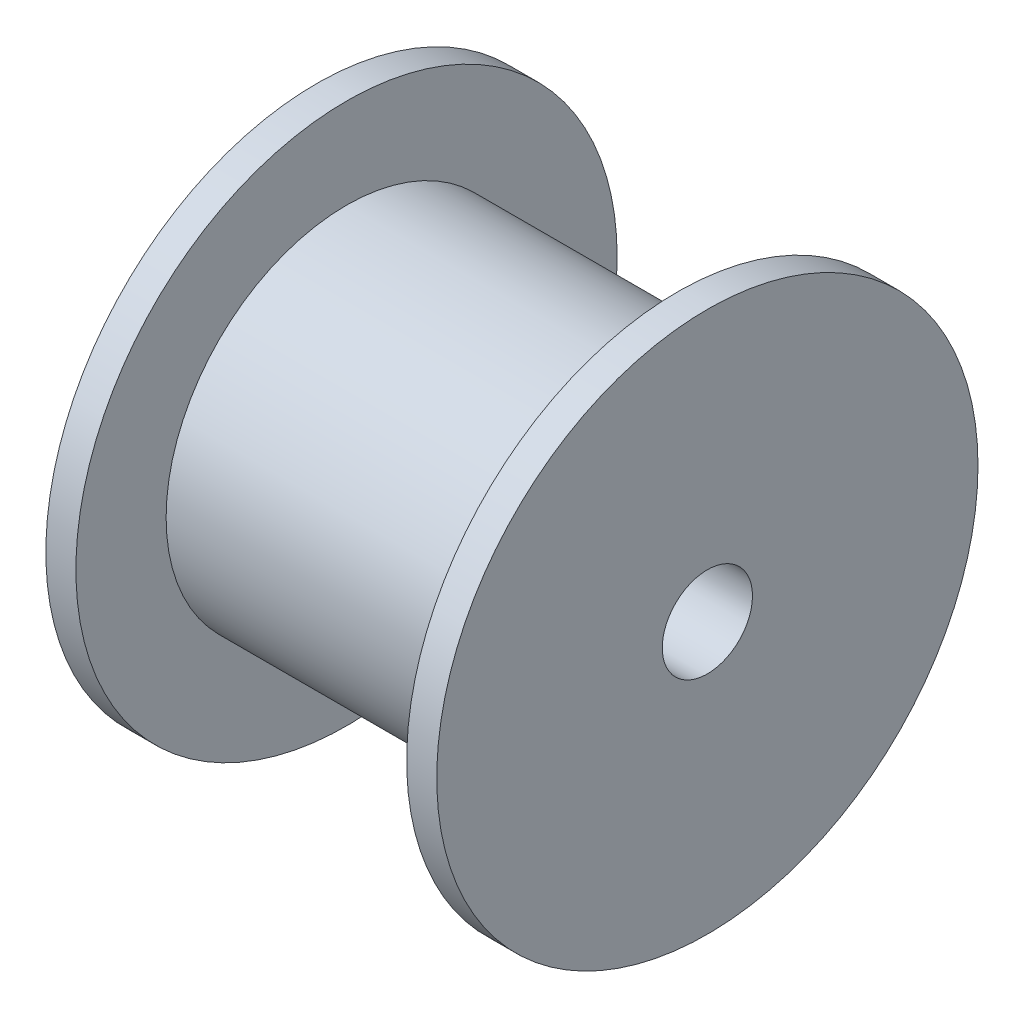
ISO-10303-21;
HEADER;
FILE_DESCRIPTION(('STEP AP214'),'2;1');
FILE_NAME('part.step','',(''),(''),'','','');
FILE_SCHEMA(('AUTOMOTIVE_DESIGN { 1 0 10303 214 1 1 1 1 }'));
ENDSEC;
DATA;
#1=APPLICATION_CONTEXT('core data for automotive mechanical design processes');
#2=APPLICATION_PROTOCOL_DEFINITION('international standard','automotive_design',2000,#1);
#3=PRODUCT_CONTEXT('',#1,'mechanical');
#4=PRODUCT('Part','Part','',(#3));
#5=PRODUCT_RELATED_PRODUCT_CATEGORY('part','',(#4));
#6=PRODUCT_DEFINITION_FORMATION('','',#4);
#7=PRODUCT_DEFINITION_CONTEXT('part definition',#1,'design');
#8=PRODUCT_DEFINITION('design','',#6,#7);
#9=PRODUCT_DEFINITION_SHAPE('','',#8);
#10=(LENGTH_UNIT() NAMED_UNIT(*) SI_UNIT(.MILLI.,.METRE.));
#11=(NAMED_UNIT(*) PLANE_ANGLE_UNIT() SI_UNIT($,.RADIAN.));
#12=(NAMED_UNIT(*) SI_UNIT($,.STERADIAN.) SOLID_ANGLE_UNIT());
#13=UNCERTAINTY_MEASURE_WITH_UNIT(LENGTH_MEASURE(1.E-05),#10,'distance_accuracy_value','');
#14=(GEOMETRIC_REPRESENTATION_CONTEXT(3) GLOBAL_UNCERTAINTY_ASSIGNED_CONTEXT((#13)) GLOBAL_UNIT_ASSIGNED_CONTEXT((#10,
#11,#12)) REPRESENTATION_CONTEXT('',''));
#15=CARTESIAN_POINT('',(0.,0.,0.));
#16=DIRECTION('',(0.,0.,1.));
#17=DIRECTION('',(1.,0.,0.));
#18=AXIS2_PLACEMENT_3D('',#15,#16,#17);
#19=CARTESIAN_POINT('',(1.,0.,0.));
#20=DIRECTION('',(1.,0.,0.));
#21=DIRECTION('',(0.,0.,-1.));
#22=AXIS2_PLACEMENT_3D('',#19,#20,#21);
#23=PLANE('',#22);
#24=CARTESIAN_POINT('',(1.,0.,0.));
#25=DIRECTION('',(1.,0.,0.));
#26=DIRECTION('',(0.,0.,-1.));
#27=AXIS2_PLACEMENT_3D('',#24,#25,#26);
#28=CIRCLE('',#27,6.);
#29=CARTESIAN_POINT('',(1.,0.,-6.));
#30=VERTEX_POINT('',#29);
#31=EDGE_CURVE('E10',#30,#30,#28,.T.);
#32=ORIENTED_EDGE('',*,*,#31,.F.);
#33=EDGE_LOOP('',(#32));
#34=FACE_BOUND('',#33,.T.);
#35=CARTESIAN_POINT('',(1.,0.,0.));
#36=DIRECTION('',(1.,0.,0.));
#37=DIRECTION('',(0.,0.,-1.));
#38=AXIS2_PLACEMENT_3D('',#35,#36,#37);
#39=CIRCLE('',#38,9.);
#40=CARTESIAN_POINT('',(1.,0.,-9.));
#41=VERTEX_POINT('',#40);
#42=EDGE_CURVE('E39',#41,#41,#39,.T.);
#43=ORIENTED_EDGE('',*,*,#42,.T.);
#44=EDGE_LOOP('',(#43));
#45=FACE_BOUND('',#44,.T.);
#46=ADVANCED_FACE('F31',(#34,#45),#23,.T.);
#47=CARTESIAN_POINT('',(0.,0.,0.));
#48=DIRECTION('',(1.,0.,0.));
#49=DIRECTION('',(0.,0.,-1.));
#50=AXIS2_PLACEMENT_3D('',#47,#48,#49);
#51=PLANE('',#50);
#52=CARTESIAN_POINT('',(0.,0.,0.));
#53=DIRECTION('',(1.,0.,0.));
#54=DIRECTION('',(0.,0.,-1.));
#55=AXIS2_PLACEMENT_3D('',#52,#53,#54);
#56=CIRCLE('',#55,9.);
#57=CARTESIAN_POINT('',(0.,0.,-9.));
#58=VERTEX_POINT('',#57);
#59=EDGE_CURVE('E35',#58,#58,#56,.T.);
#60=ORIENTED_EDGE('',*,*,#59,.F.);
#61=EDGE_LOOP('',(#60));
#62=FACE_BOUND('',#61,.T.);
#63=CARTESIAN_POINT('',(0.,0.,0.));
#64=DIRECTION('',(1.,0.,0.));
#65=DIRECTION('',(0.,0.,-1.));
#66=AXIS2_PLACEMENT_3D('',#63,#64,#65);
#67=CIRCLE('',#66,1.5);
#68=CARTESIAN_POINT('',(0.,0.,-1.5));
#69=VERTEX_POINT('',#68);
#70=EDGE_CURVE('E48',#69,#69,#67,.T.);
#71=ORIENTED_EDGE('',*,*,#70,.T.);
#72=EDGE_LOOP('',(#71));
#73=FACE_BOUND('',#72,.T.);
#74=ADVANCED_FACE('F84',(#62,#73),#51,.F.);
#75=CARTESIAN_POINT('',(1.,0.,0.));
#76=DIRECTION('',(-1.,0.,0.));
#77=DIRECTION('',(0.,0.,1.));
#78=AXIS2_PLACEMENT_3D('',#75,#76,#77);
#79=CYLINDRICAL_SURFACE('',#78,9.);
#80=ORIENTED_EDGE('',*,*,#42,.F.);
#81=EDGE_LOOP('',(#80));
#82=FACE_BOUND('',#81,.T.);
#83=ORIENTED_EDGE('',*,*,#59,.T.);
#84=EDGE_LOOP('',(#83));
#85=FACE_BOUND('',#84,.T.);
#86=ADVANCED_FACE('F33',(#82,#85),#79,.T.);
#87=CARTESIAN_POINT('',(1.,0.,0.));
#88=DIRECTION('',(-1.,0.,0.));
#89=DIRECTION('',(0.,0.,1.));
#90=AXIS2_PLACEMENT_3D('',#87,#88,#89);
#91=CYLINDRICAL_SURFACE('',#90,1.5);
#92=ORIENTED_EDGE('',*,*,#70,.F.);
#93=EDGE_LOOP('',(#92));
#94=FACE_BOUND('',#93,.T.);
#95=CARTESIAN_POINT('',(13.,0.,0.));
#96=DIRECTION('',(1.,0.,0.));
#97=DIRECTION('',(0.,0.,-1.));
#98=AXIS2_PLACEMENT_3D('',#95,#96,#97);
#99=CIRCLE('',#98,1.5);
#100=CARTESIAN_POINT('',(13.,0.,-1.5));
#101=VERTEX_POINT('',#100);
#102=EDGE_CURVE('E63',#101,#101,#99,.T.);
#103=ORIENTED_EDGE('',*,*,#102,.T.);
#104=EDGE_LOOP('',(#103));
#105=FACE_BOUND('',#104,.T.);
#106=ADVANCED_FACE('F68',(#94,#105),#91,.F.);
#107=CARTESIAN_POINT('',(12.,0.,0.));
#108=DIRECTION('',(-1.,0.,0.));
#109=DIRECTION('',(0.,0.,1.));
#110=AXIS2_PLACEMENT_3D('',#107,#108,#109);
#111=CYLINDRICAL_SURFACE('',#110,6.);
#112=CARTESIAN_POINT('',(12.,0.,0.));
#113=DIRECTION('',(1.,0.,0.));
#114=DIRECTION('',(0.,0.,-1.));
#115=AXIS2_PLACEMENT_3D('',#112,#113,#114);
#116=CIRCLE('',#115,6.);
#117=CARTESIAN_POINT('',(12.,0.,-6.));
#118=VERTEX_POINT('',#117);
#119=EDGE_CURVE('E46',#118,#118,#116,.T.);
#120=ORIENTED_EDGE('',*,*,#119,.F.);
#121=EDGE_LOOP('',(#120));
#122=FACE_BOUND('',#121,.T.);
#123=ORIENTED_EDGE('',*,*,#31,.T.);
#124=EDGE_LOOP('',(#123));
#125=FACE_BOUND('',#124,.T.);
#126=ADVANCED_FACE('F73',(#122,#125),#111,.T.);
#127=CARTESIAN_POINT('',(13.,0.,0.));
#128=DIRECTION('',(1.,0.,0.));
#129=DIRECTION('',(0.,0.,-1.));
#130=AXIS2_PLACEMENT_3D('',#127,#128,#129);
#131=PLANE('',#130);
#132=CARTESIAN_POINT('',(13.,0.,0.));
#133=DIRECTION('',(1.,0.,0.));
#134=DIRECTION('',(0.,0.,-1.));
#135=AXIS2_PLACEMENT_3D('',#132,#133,#134);
#136=CIRCLE('',#135,9.);
#137=CARTESIAN_POINT('',(13.,0.,-9.));
#138=VERTEX_POINT('',#137);
#139=EDGE_CURVE('E54',#138,#138,#136,.T.);
#140=ORIENTED_EDGE('',*,*,#139,.T.);
#141=EDGE_LOOP('',(#140));
#142=FACE_BOUND('',#141,.T.);
#143=ORIENTED_EDGE('',*,*,#102,.F.);
#144=EDGE_LOOP('',(#143));
#145=FACE_BOUND('',#144,.T.);
#146=ADVANCED_FACE('F70',(#142,#145),#131,.T.);
#147=CARTESIAN_POINT('',(12.,0.,0.));
#148=DIRECTION('',(1.,0.,0.));
#149=DIRECTION('',(0.,0.,-1.));
#150=AXIS2_PLACEMENT_3D('',#147,#148,#149);
#151=PLANE('',#150);
#152=ORIENTED_EDGE('',*,*,#119,.T.);
#153=EDGE_LOOP('',(#152));
#154=FACE_BOUND('',#153,.T.);
#155=CARTESIAN_POINT('',(12.,0.,0.));
#156=DIRECTION('',(1.,0.,0.));
#157=DIRECTION('',(0.,0.,-1.));
#158=AXIS2_PLACEMENT_3D('',#155,#156,#157);
#159=CIRCLE('',#158,9.);
#160=CARTESIAN_POINT('',(12.,0.,-9.));
#161=VERTEX_POINT('',#160);
#162=EDGE_CURVE('E58',#161,#161,#159,.T.);
#163=ORIENTED_EDGE('',*,*,#162,.F.);
#164=EDGE_LOOP('',(#163));
#165=FACE_BOUND('',#164,.T.);
#166=ADVANCED_FACE('F72',(#154,#165),#151,.F.);
#167=CARTESIAN_POINT('',(13.,0.,0.));
#168=DIRECTION('',(-1.,0.,0.));
#169=DIRECTION('',(0.,0.,1.));
#170=AXIS2_PLACEMENT_3D('',#167,#168,#169);
#171=CYLINDRICAL_SURFACE('',#170,9.);
#172=ORIENTED_EDGE('',*,*,#139,.F.);
#173=EDGE_LOOP('',(#172));
#174=FACE_BOUND('',#173,.T.);
#175=ORIENTED_EDGE('',*,*,#162,.T.);
#176=EDGE_LOOP('',(#175));
#177=FACE_BOUND('',#176,.T.);
#178=ADVANCED_FACE('F79',(#174,#177),#171,.T.);
#179=CLOSED_SHELL('',(#46,#74,#86,#106,#126,#146,#166,#178));
#180=MANIFOLD_SOLID_BREP('B2',#179);
#181=ADVANCED_BREP_SHAPE_REPRESENTATION('',(#18,#180),#14);
#182=SHAPE_DEFINITION_REPRESENTATION(#9,#181);
ENDSEC;
END-ISO-10303-21;
